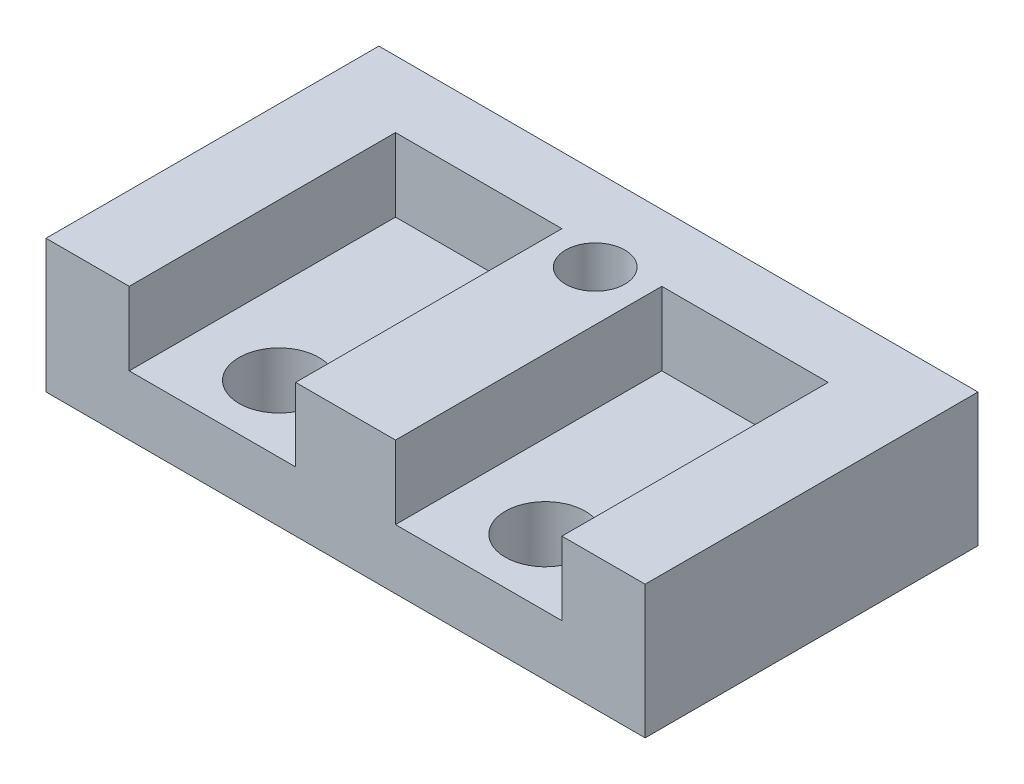
ISO-10303-21;
HEADER;
FILE_DESCRIPTION(('STEP AP214'),'2;1');
FILE_NAME('part.step','',(''),(''),'','','');
FILE_SCHEMA(('AUTOMOTIVE_DESIGN { 1 0 10303 214 1 1 1 1 }'));
ENDSEC;
DATA;
#1=APPLICATION_CONTEXT('core data for automotive mechanical design processes');
#2=APPLICATION_PROTOCOL_DEFINITION('international standard','automotive_design',2000,#1);
#3=PRODUCT_CONTEXT('',#1,'mechanical');
#4=PRODUCT('Part','Part','',(#3));
#5=PRODUCT_RELATED_PRODUCT_CATEGORY('part','',(#4));
#6=PRODUCT_DEFINITION_FORMATION('','',#4);
#7=PRODUCT_DEFINITION_CONTEXT('part definition',#1,'design');
#8=PRODUCT_DEFINITION('design','',#6,#7);
#9=PRODUCT_DEFINITION_SHAPE('','',#8);
#10=(LENGTH_UNIT() NAMED_UNIT(*) SI_UNIT(.MILLI.,.METRE.));
#11=(NAMED_UNIT(*) PLANE_ANGLE_UNIT() SI_UNIT($,.RADIAN.));
#12=(NAMED_UNIT(*) SI_UNIT($,.STERADIAN.) SOLID_ANGLE_UNIT());
#13=UNCERTAINTY_MEASURE_WITH_UNIT(LENGTH_MEASURE(1.E-05),#10,'distance_accuracy_value','');
#14=(GEOMETRIC_REPRESENTATION_CONTEXT(3) GLOBAL_UNCERTAINTY_ASSIGNED_CONTEXT((#13)) GLOBAL_UNIT_ASSIGNED_CONTEXT((#10,
#11,#12)) REPRESENTATION_CONTEXT('',''));
#15=CARTESIAN_POINT('',(0.,0.,0.));
#16=DIRECTION('',(0.,0.,1.));
#17=DIRECTION('',(1.,0.,0.));
#18=AXIS2_PLACEMENT_3D('',#15,#16,#17);
#19=CARTESIAN_POINT('',(11.43,5.08,6.35));
#20=DIRECTION('',(-1.,0.,0.));
#21=DIRECTION('',(0.,0.,1.));
#22=AXIS2_PLACEMENT_3D('',#19,#20,#21);
#23=PLANE('',#22);
#24=DIRECTION('',(0.,0.,-1.));
#25=VECTOR('',#24,1.);
#26=CARTESIAN_POINT('',(11.43,0.,6.35));
#27=LINE('',#26,#25);
#28=CARTESIAN_POINT('',(11.43,0.,6.35));
#29=VERTEX_POINT('',#28);
#30=CARTESIAN_POINT('',(11.43,0.,-6.35));
#31=VERTEX_POINT('',#30);
#32=EDGE_CURVE('E203',#29,#31,#27,.T.);
#33=ORIENTED_EDGE('',*,*,#32,.T.);
#34=DIRECTION('',(0.,-1.,0.));
#35=VECTOR('',#34,1.);
#36=CARTESIAN_POINT('',(11.43,5.08,-6.35));
#37=LINE('',#36,#35);
#38=CARTESIAN_POINT('',(11.43,5.08,-6.35));
#39=VERTEX_POINT('',#38);
#40=EDGE_CURVE('E11',#39,#31,#37,.T.);
#41=ORIENTED_EDGE('',*,*,#40,.F.);
#42=DIRECTION('',(0.,0.,-1.));
#43=VECTOR('',#42,1.);
#44=CARTESIAN_POINT('',(11.43,5.08,6.35));
#45=LINE('',#44,#43);
#46=CARTESIAN_POINT('',(11.43,5.08,6.35));
#47=VERTEX_POINT('',#46);
#48=EDGE_CURVE('E204',#47,#39,#45,.T.);
#49=ORIENTED_EDGE('',*,*,#48,.F.);
#50=DIRECTION('',(0.,-1.,0.));
#51=VECTOR('',#50,1.);
#52=CARTESIAN_POINT('',(11.43,5.08,6.35));
#53=LINE('',#52,#51);
#54=EDGE_CURVE('E216',#47,#29,#53,.T.);
#55=ORIENTED_EDGE('',*,*,#54,.T.);
#56=EDGE_LOOP('',(#33,#41,#49,#55));
#57=FACE_BOUND('',#56,.T.);
#58=ADVANCED_FACE('F45',(#57),#23,.F.);
#59=CARTESIAN_POINT('',(-11.43,5.08,-6.35));
#60=DIRECTION('',(0.,0.,1.));
#61=DIRECTION('',(1.,0.,0.));
#62=AXIS2_PLACEMENT_3D('',#59,#60,#61);
#63=PLANE('',#62);
#64=DIRECTION('',(-1.,0.,0.));
#65=VECTOR('',#64,1.);
#66=CARTESIAN_POINT('',(-11.43,0.,-6.35));
#67=LINE('',#66,#65);
#68=CARTESIAN_POINT('',(-11.43,0.,-6.35));
#69=VERTEX_POINT('',#68);
#70=EDGE_CURVE('E220',#31,#69,#67,.T.);
#71=ORIENTED_EDGE('',*,*,#70,.T.);
#72=DIRECTION('',(0.,-1.,0.));
#73=VECTOR('',#72,1.);
#74=CARTESIAN_POINT('',(-11.43,5.08,-6.35));
#75=LINE('',#74,#73);
#76=CARTESIAN_POINT('',(-11.43,5.08,-6.35));
#77=VERTEX_POINT('',#76);
#78=EDGE_CURVE('E52',#77,#69,#75,.T.);
#79=ORIENTED_EDGE('',*,*,#78,.F.);
#80=DIRECTION('',(-1.,0.,0.));
#81=VECTOR('',#80,1.);
#82=CARTESIAN_POINT('',(-11.43,5.08,-6.35));
#83=LINE('',#82,#81);
#84=EDGE_CURVE('E207',#39,#77,#83,.T.);
#85=ORIENTED_EDGE('',*,*,#84,.F.);
#86=ORIENTED_EDGE('',*,*,#40,.T.);
#87=EDGE_LOOP('',(#71,#79,#85,#86));
#88=FACE_BOUND('',#87,.T.);
#89=ADVANCED_FACE('F278',(#88),#63,.F.);
#90=CARTESIAN_POINT('',(-11.43,5.08,6.35));
#91=DIRECTION('',(1.,0.,0.));
#92=DIRECTION('',(0.,0.,-1.));
#93=AXIS2_PLACEMENT_3D('',#90,#91,#92);
#94=PLANE('',#93);
#95=DIRECTION('',(0.,0.,1.));
#96=VECTOR('',#95,1.);
#97=CARTESIAN_POINT('',(-11.43,0.,6.35));
#98=LINE('',#97,#96);
#99=CARTESIAN_POINT('',(-11.43,0.,6.35));
#100=VERTEX_POINT('',#99);
#101=EDGE_CURVE('E222',#69,#100,#98,.T.);
#102=ORIENTED_EDGE('',*,*,#101,.T.);
#103=DIRECTION('',(0.,-1.,0.));
#104=VECTOR('',#103,1.);
#105=CARTESIAN_POINT('',(-11.43,5.08,6.35));
#106=LINE('',#105,#104);
#107=CARTESIAN_POINT('',(-11.43,5.08,6.35));
#108=VERTEX_POINT('',#107);
#109=EDGE_CURVE('E227',#108,#100,#106,.T.);
#110=ORIENTED_EDGE('',*,*,#109,.F.);
#111=DIRECTION('',(0.,0.,1.));
#112=VECTOR('',#111,1.);
#113=CARTESIAN_POINT('',(-11.43,5.08,6.35));
#114=LINE('',#113,#112);
#115=EDGE_CURVE('E210',#77,#108,#114,.T.);
#116=ORIENTED_EDGE('',*,*,#115,.F.);
#117=ORIENTED_EDGE('',*,*,#78,.T.);
#118=EDGE_LOOP('',(#102,#110,#116,#117));
#119=FACE_BOUND('',#118,.T.);
#120=ADVANCED_FACE('F234',(#119),#94,.F.);
#121=CARTESIAN_POINT('',(-11.43,5.08,6.35));
#122=DIRECTION('',(0.,0.,-1.));
#123=DIRECTION('',(-1.,0.,0.));
#124=AXIS2_PLACEMENT_3D('',#121,#122,#123);
#125=PLANE('',#124);
#126=DIRECTION('',(1.,0.,0.));
#127=VECTOR('',#126,1.);
#128=CARTESIAN_POINT('',(-11.43,5.08,6.35));
#129=LINE('',#128,#127);
#130=CARTESIAN_POINT('',(-1.905,5.08,6.35));
#131=VERTEX_POINT('',#130);
#132=CARTESIAN_POINT('',(1.905,5.08,6.35));
#133=VERTEX_POINT('',#132);
#134=EDGE_CURVE('E217',#131,#133,#129,.T.);
#135=ORIENTED_EDGE('',*,*,#134,.F.);
#136=DIRECTION('',(0.,1.,0.));
#137=VECTOR('',#136,1.);
#138=CARTESIAN_POINT('',(-1.905,2.286,6.35));
#139=LINE('',#138,#137);
#140=CARTESIAN_POINT('',(-1.905,2.286,6.35));
#141=VERTEX_POINT('',#140);
#142=EDGE_CURVE('E165',#141,#131,#139,.T.);
#143=ORIENTED_EDGE('',*,*,#142,.F.);
#144=DIRECTION('',(1.,0.,0.));
#145=VECTOR('',#144,1.);
#146=CARTESIAN_POINT('',(-1.905,2.286,6.35));
#147=LINE('',#146,#145);
#148=CARTESIAN_POINT('',(-8.255,2.286,6.35));
#149=VERTEX_POINT('',#148);
#150=EDGE_CURVE('E140',#149,#141,#147,.T.);
#151=ORIENTED_EDGE('',*,*,#150,.F.);
#152=DIRECTION('',(0.,1.,0.));
#153=VECTOR('',#152,1.);
#154=CARTESIAN_POINT('',(-8.255,2.286,6.35));
#155=LINE('',#154,#153);
#156=CARTESIAN_POINT('',(-8.255,5.08,6.35));
#157=VERTEX_POINT('',#156);
#158=EDGE_CURVE('E168',#149,#157,#155,.T.);
#159=ORIENTED_EDGE('',*,*,#158,.T.);
#160=EDGE_CURVE('E213',#108,#157,#129,.T.);
#161=ORIENTED_EDGE('',*,*,#160,.F.);
#162=ORIENTED_EDGE('',*,*,#109,.T.);
#163=DIRECTION('',(1.,0.,0.));
#164=VECTOR('',#163,1.);
#165=CARTESIAN_POINT('',(-11.43,0.,6.35));
#166=LINE('',#165,#164);
#167=EDGE_CURVE('E208',#100,#29,#166,.T.);
#168=ORIENTED_EDGE('',*,*,#167,.T.);
#169=ORIENTED_EDGE('',*,*,#54,.F.);
#170=CARTESIAN_POINT('',(8.255,5.08,6.35));
#171=VERTEX_POINT('',#170);
#172=EDGE_CURVE('E212',#171,#47,#129,.T.);
#173=ORIENTED_EDGE('',*,*,#172,.F.);
#174=DIRECTION('',(0.,1.,0.));
#175=VECTOR('',#174,1.);
#176=CARTESIAN_POINT('',(8.255,2.286,6.35));
#177=LINE('',#176,#175);
#178=CARTESIAN_POINT('',(8.255,2.286,6.35));
#179=VERTEX_POINT('',#178);
#180=EDGE_CURVE('E178',#179,#171,#177,.T.);
#181=ORIENTED_EDGE('',*,*,#180,.F.);
#182=DIRECTION('',(1.,0.,0.));
#183=VECTOR('',#182,1.);
#184=CARTESIAN_POINT('',(1.905,2.286,6.35));
#185=LINE('',#184,#183);
#186=CARTESIAN_POINT('',(1.905,2.286,6.35));
#187=VERTEX_POINT('',#186);
#188=EDGE_CURVE('E191',#187,#179,#185,.T.);
#189=ORIENTED_EDGE('',*,*,#188,.F.);
#190=DIRECTION('',(0.,1.,0.));
#191=VECTOR('',#190,1.);
#192=CARTESIAN_POINT('',(1.905,2.286,6.35));
#193=LINE('',#192,#191);
#194=EDGE_CURVE('E175',#187,#133,#193,.T.);
#195=ORIENTED_EDGE('',*,*,#194,.T.);
#196=EDGE_LOOP('',(#135,#143,#151,#159,#161,#162,#168,#169,#173,#181,#189,#195));
#197=FACE_BOUND('',#196,.T.);
#198=ADVANCED_FACE('F244',(#197),#125,.F.);
#199=CARTESIAN_POINT('',(0.,5.08,0.));
#200=DIRECTION('',(0.,-1.,0.));
#201=DIRECTION('',(0.,0.,-1.));
#202=AXIS2_PLACEMENT_3D('',#199,#200,#201);
#203=PLANE('',#202);
#204=CARTESIAN_POINT('',(0.,5.08,-3.175));
#205=DIRECTION('',(0.,1.,0.));
#206=DIRECTION('',(0.,0.,1.));
#207=AXIS2_PLACEMENT_3D('',#204,#205,#206);
#208=CIRCLE('',#207,1.13029999999999);
#209=CARTESIAN_POINT('',(0.,5.08,-2.04470000000001));
#210=VERTEX_POINT('',#209);
#211=EDGE_CURVE('E167',#210,#210,#208,.T.);
#212=ORIENTED_EDGE('',*,*,#211,.F.);
#213=EDGE_LOOP('',(#212));
#214=FACE_BOUND('',#213,.T.);
#215=DIRECTION('',(-1.,0.,0.));
#216=VECTOR('',#215,1.);
#217=CARTESIAN_POINT('',(-1.905,5.08,-3.81));
#218=LINE('',#217,#216);
#219=CARTESIAN_POINT('',(-1.905,5.08,-3.81));
#220=VERTEX_POINT('',#219);
#221=CARTESIAN_POINT('',(-8.255,5.08,-3.81));
#222=VERTEX_POINT('',#221);
#223=EDGE_CURVE('E155',#220,#222,#218,.T.);
#224=ORIENTED_EDGE('',*,*,#223,.F.);
#225=DIRECTION('',(0.,0.,-1.));
#226=VECTOR('',#225,1.);
#227=CARTESIAN_POINT('',(-1.905,5.08,-3.81));
#228=LINE('',#227,#226);
#229=EDGE_CURVE('E59',#131,#220,#228,.T.);
#230=ORIENTED_EDGE('',*,*,#229,.F.);
#231=ORIENTED_EDGE('',*,*,#134,.T.);
#232=DIRECTION('',(0.,0.,1.));
#233=VECTOR('',#232,1.);
#234=CARTESIAN_POINT('',(1.905,5.08,-3.81));
#235=LINE('',#234,#233);
#236=CARTESIAN_POINT('',(1.905,5.08,-3.81));
#237=VERTEX_POINT('',#236);
#238=EDGE_CURVE('E185',#237,#133,#235,.T.);
#239=ORIENTED_EDGE('',*,*,#238,.F.);
#240=DIRECTION('',(-1.,0.,0.));
#241=VECTOR('',#240,1.);
#242=CARTESIAN_POINT('',(1.905,5.08,-3.81));
#243=LINE('',#242,#241);
#244=CARTESIAN_POINT('',(8.255,5.08,-3.81));
#245=VERTEX_POINT('',#244);
#246=EDGE_CURVE('E67',#245,#237,#243,.T.);
#247=ORIENTED_EDGE('',*,*,#246,.F.);
#248=DIRECTION('',(0.,0.,-1.));
#249=VECTOR('',#248,1.);
#250=CARTESIAN_POINT('',(8.255,5.08,-3.81));
#251=LINE('',#250,#249);
#252=EDGE_CURVE('E182',#171,#245,#251,.T.);
#253=ORIENTED_EDGE('',*,*,#252,.F.);
#254=ORIENTED_EDGE('',*,*,#172,.T.);
#255=ORIENTED_EDGE('',*,*,#48,.T.);
#256=ORIENTED_EDGE('',*,*,#84,.T.);
#257=ORIENTED_EDGE('',*,*,#115,.T.);
#258=ORIENTED_EDGE('',*,*,#160,.T.);
#259=DIRECTION('',(0.,0.,1.));
#260=VECTOR('',#259,1.);
#261=CARTESIAN_POINT('',(-8.255,5.08,-3.81));
#262=LINE('',#261,#260);
#263=EDGE_CURVE('E153',#222,#157,#262,.T.);
#264=ORIENTED_EDGE('',*,*,#263,.F.);
#265=EDGE_LOOP('',(#224,#230,#231,#239,#247,#253,#254,#255,#256,#257,#258,#264));
#266=FACE_BOUND('',#265,.T.);
#267=ADVANCED_FACE('F251',(#214,#266),#203,.F.);
#268=CARTESIAN_POINT('',(0.,0.,0.));
#269=DIRECTION('',(0.,-1.,0.));
#270=DIRECTION('',(0.,0.,-1.));
#271=AXIS2_PLACEMENT_3D('',#268,#269,#270);
#272=PLANE('',#271);
#273=CARTESIAN_POINT('',(-5.08,0.,3.81));
#274=DIRECTION('',(0.,-1.,0.));
#275=DIRECTION('',(0.,0.,-1.));
#276=AXIS2_PLACEMENT_3D('',#273,#274,#275);
#277=CIRCLE('',#276,1.524);
#278=CARTESIAN_POINT('',(-5.08,0.,2.286));
#279=VERTEX_POINT('',#278);
#280=EDGE_CURVE('E308',#279,#279,#277,.T.);
#281=ORIENTED_EDGE('',*,*,#280,.F.);
#282=EDGE_LOOP('',(#281));
#283=FACE_BOUND('',#282,.T.);
#284=CARTESIAN_POINT('',(5.08,0.,3.81));
#285=DIRECTION('',(0.,-1.,0.));
#286=DIRECTION('',(0.,0.,-1.));
#287=AXIS2_PLACEMENT_3D('',#284,#285,#286);
#288=CIRCLE('',#287,1.524);
#289=CARTESIAN_POINT('',(5.08,0.,2.286));
#290=VERTEX_POINT('',#289);
#291=EDGE_CURVE('E158',#290,#290,#288,.T.);
#292=ORIENTED_EDGE('',*,*,#291,.F.);
#293=EDGE_LOOP('',(#292));
#294=FACE_BOUND('',#293,.T.);
#295=CARTESIAN_POINT('',(0.,0.,-3.175));
#296=DIRECTION('',(0.,-1.,0.));
#297=DIRECTION('',(0.,0.,-1.));
#298=AXIS2_PLACEMENT_3D('',#295,#296,#297);
#299=CIRCLE('',#298,1.13029999999999);
#300=CARTESIAN_POINT('',(0.,0.,-4.30529999999999));
#301=VERTEX_POINT('',#300);
#302=EDGE_CURVE('E200',#301,#301,#299,.T.);
#303=ORIENTED_EDGE('',*,*,#302,.F.);
#304=EDGE_LOOP('',(#303));
#305=FACE_BOUND('',#304,.T.);
#306=ORIENTED_EDGE('',*,*,#32,.F.);
#307=ORIENTED_EDGE('',*,*,#167,.F.);
#308=ORIENTED_EDGE('',*,*,#101,.F.);
#309=ORIENTED_EDGE('',*,*,#70,.F.);
#310=EDGE_LOOP('',(#306,#307,#308,#309));
#311=FACE_BOUND('',#310,.T.);
#312=ADVANCED_FACE('F240',(#283,#294,#305,#311),#272,.T.);
#313=CARTESIAN_POINT('',(0.,5.08,-3.175));
#314=DIRECTION('',(0.,1.,0.));
#315=DIRECTION('',(0.,0.,1.));
#316=AXIS2_PLACEMENT_3D('',#313,#314,#315);
#317=CYLINDRICAL_SURFACE('',#316,1.13029999999999);
#318=ORIENTED_EDGE('',*,*,#302,.T.);
#319=EDGE_LOOP('',(#318));
#320=FACE_BOUND('',#319,.T.);
#321=ORIENTED_EDGE('',*,*,#211,.T.);
#322=EDGE_LOOP('',(#321));
#323=FACE_BOUND('',#322,.T.);
#324=ADVANCED_FACE('F274',(#320,#323),#317,.F.);
#325=CARTESIAN_POINT('',(1.905,2.286,-3.81));
#326=DIRECTION('',(0.,0.,-1.));
#327=DIRECTION('',(-1.,0.,0.));
#328=AXIS2_PLACEMENT_3D('',#325,#326,#327);
#329=PLANE('',#328);
#330=ORIENTED_EDGE('',*,*,#246,.T.);
#331=DIRECTION('',(0.,1.,0.));
#332=VECTOR('',#331,1.);
#333=CARTESIAN_POINT('',(1.905,2.286,-3.81));
#334=LINE('',#333,#332);
#335=CARTESIAN_POINT('',(1.905,2.286,-3.81));
#336=VERTEX_POINT('',#335);
#337=EDGE_CURVE('E172',#336,#237,#334,.T.);
#338=ORIENTED_EDGE('',*,*,#337,.F.);
#339=DIRECTION('',(-1.,0.,0.));
#340=VECTOR('',#339,1.);
#341=CARTESIAN_POINT('',(1.905,2.286,-3.81));
#342=LINE('',#341,#340);
#343=CARTESIAN_POINT('',(8.255,2.286,-3.81));
#344=VERTEX_POINT('',#343);
#345=EDGE_CURVE('E186',#344,#336,#342,.T.);
#346=ORIENTED_EDGE('',*,*,#345,.F.);
#347=DIRECTION('',(0.,1.,0.));
#348=VECTOR('',#347,1.);
#349=CARTESIAN_POINT('',(8.255,2.286,-3.81));
#350=LINE('',#349,#348);
#351=EDGE_CURVE('E180',#344,#245,#350,.T.);
#352=ORIENTED_EDGE('',*,*,#351,.T.);
#353=EDGE_LOOP('',(#330,#338,#346,#352));
#354=FACE_BOUND('',#353,.T.);
#355=ADVANCED_FACE('F264',(#354),#329,.F.);
#356=CARTESIAN_POINT('',(8.255,2.286,-3.81));
#357=DIRECTION('',(1.,0.,0.));
#358=DIRECTION('',(0.,0.,-1.));
#359=AXIS2_PLACEMENT_3D('',#356,#357,#358);
#360=PLANE('',#359);
#361=ORIENTED_EDGE('',*,*,#252,.T.);
#362=ORIENTED_EDGE('',*,*,#351,.F.);
#363=DIRECTION('',(0.,0.,-1.));
#364=VECTOR('',#363,1.);
#365=CARTESIAN_POINT('',(8.255,2.286,-3.81));
#366=LINE('',#365,#364);
#367=EDGE_CURVE('E174',#179,#344,#366,.T.);
#368=ORIENTED_EDGE('',*,*,#367,.F.);
#369=ORIENTED_EDGE('',*,*,#180,.T.);
#370=EDGE_LOOP('',(#361,#362,#368,#369));
#371=FACE_BOUND('',#370,.T.);
#372=ADVANCED_FACE('F266',(#371),#360,.F.);
#373=CARTESIAN_POINT('',(1.905,2.286,-3.81));
#374=DIRECTION('',(-1.,0.,0.));
#375=DIRECTION('',(0.,0.,1.));
#376=AXIS2_PLACEMENT_3D('',#373,#374,#375);
#377=PLANE('',#376);
#378=ORIENTED_EDGE('',*,*,#238,.T.);
#379=ORIENTED_EDGE('',*,*,#194,.F.);
#380=DIRECTION('',(0.,0.,1.));
#381=VECTOR('',#380,1.);
#382=CARTESIAN_POINT('',(1.905,2.286,-3.81));
#383=LINE('',#382,#381);
#384=EDGE_CURVE('E193',#336,#187,#383,.T.);
#385=ORIENTED_EDGE('',*,*,#384,.F.);
#386=ORIENTED_EDGE('',*,*,#337,.T.);
#387=EDGE_LOOP('',(#378,#379,#385,#386));
#388=FACE_BOUND('',#387,.T.);
#389=ADVANCED_FACE('F259',(#388),#377,.F.);
#390=CARTESIAN_POINT('',(0.,2.286,0.));
#391=DIRECTION('',(0.,-1.,0.));
#392=DIRECTION('',(0.,0.,-1.));
#393=AXIS2_PLACEMENT_3D('',#390,#391,#392);
#394=PLANE('',#393);
#395=CARTESIAN_POINT('',(5.08,2.286,3.81));
#396=DIRECTION('',(0.,1.,0.));
#397=DIRECTION('',(0.,0.,1.));
#398=AXIS2_PLACEMENT_3D('',#395,#396,#397);
#399=CIRCLE('',#398,1.524);
#400=CARTESIAN_POINT('',(5.08,2.286,5.334));
#401=VERTEX_POINT('',#400);
#402=EDGE_CURVE('E306',#401,#401,#399,.T.);
#403=ORIENTED_EDGE('',*,*,#402,.F.);
#404=EDGE_LOOP('',(#403));
#405=FACE_BOUND('',#404,.T.);
#406=ORIENTED_EDGE('',*,*,#345,.T.);
#407=ORIENTED_EDGE('',*,*,#384,.T.);
#408=ORIENTED_EDGE('',*,*,#188,.T.);
#409=ORIENTED_EDGE('',*,*,#367,.T.);
#410=EDGE_LOOP('',(#406,#407,#408,#409));
#411=FACE_BOUND('',#410,.T.);
#412=ADVANCED_FACE('F261',(#405,#411),#394,.F.);
#413=CARTESIAN_POINT('',(-1.905,2.286,-3.81));
#414=DIRECTION('',(1.,0.,0.));
#415=DIRECTION('',(0.,0.,-1.));
#416=AXIS2_PLACEMENT_3D('',#413,#414,#415);
#417=PLANE('',#416);
#418=ORIENTED_EDGE('',*,*,#229,.T.);
#419=DIRECTION('',(0.,1.,0.));
#420=VECTOR('',#419,1.);
#421=CARTESIAN_POINT('',(-1.905,2.286,-3.81));
#422=LINE('',#421,#420);
#423=CARTESIAN_POINT('',(-1.905,2.286,-3.81));
#424=VERTEX_POINT('',#423);
#425=EDGE_CURVE('E130',#424,#220,#422,.T.);
#426=ORIENTED_EDGE('',*,*,#425,.F.);
#427=DIRECTION('',(0.,0.,-1.));
#428=VECTOR('',#427,1.);
#429=CARTESIAN_POINT('',(-1.905,2.286,-3.81));
#430=LINE('',#429,#428);
#431=EDGE_CURVE('E134',#141,#424,#430,.T.);
#432=ORIENTED_EDGE('',*,*,#431,.F.);
#433=ORIENTED_EDGE('',*,*,#142,.T.);
#434=EDGE_LOOP('',(#418,#426,#432,#433));
#435=FACE_BOUND('',#434,.T.);
#436=ADVANCED_FACE('F132',(#435),#417,.F.);
#437=CARTESIAN_POINT('',(-8.255,2.286,-3.81));
#438=DIRECTION('',(-1.,0.,0.));
#439=DIRECTION('',(0.,0.,1.));
#440=AXIS2_PLACEMENT_3D('',#437,#438,#439);
#441=PLANE('',#440);
#442=ORIENTED_EDGE('',*,*,#263,.T.);
#443=ORIENTED_EDGE('',*,*,#158,.F.);
#444=DIRECTION('',(0.,0.,1.));
#445=VECTOR('',#444,1.);
#446=CARTESIAN_POINT('',(-8.255,2.286,-3.81));
#447=LINE('',#446,#445);
#448=CARTESIAN_POINT('',(-8.255,2.286,-3.81));
#449=VERTEX_POINT('',#448);
#450=EDGE_CURVE('E148',#449,#149,#447,.T.);
#451=ORIENTED_EDGE('',*,*,#450,.F.);
#452=DIRECTION('',(0.,1.,0.));
#453=VECTOR('',#452,1.);
#454=CARTESIAN_POINT('',(-8.255,2.286,-3.81));
#455=LINE('',#454,#453);
#456=EDGE_CURVE('E139',#449,#222,#455,.T.);
#457=ORIENTED_EDGE('',*,*,#456,.T.);
#458=EDGE_LOOP('',(#442,#443,#451,#457));
#459=FACE_BOUND('',#458,.T.);
#460=ADVANCED_FACE('F302',(#459),#441,.F.);
#461=CARTESIAN_POINT('',(-1.905,2.286,-3.81));
#462=DIRECTION('',(0.,0.,-1.));
#463=DIRECTION('',(-1.,0.,0.));
#464=AXIS2_PLACEMENT_3D('',#461,#462,#463);
#465=PLANE('',#464);
#466=ORIENTED_EDGE('',*,*,#223,.T.);
#467=ORIENTED_EDGE('',*,*,#456,.F.);
#468=DIRECTION('',(-1.,0.,0.));
#469=VECTOR('',#468,1.);
#470=CARTESIAN_POINT('',(-1.905,2.286,-3.81));
#471=LINE('',#470,#469);
#472=EDGE_CURVE('E143',#424,#449,#471,.T.);
#473=ORIENTED_EDGE('',*,*,#472,.F.);
#474=ORIENTED_EDGE('',*,*,#425,.T.);
#475=EDGE_LOOP('',(#466,#467,#473,#474));
#476=FACE_BOUND('',#475,.T.);
#477=ADVANCED_FACE('F144',(#476),#465,.F.);
#478=CARTESIAN_POINT('',(0.,2.286,0.));
#479=DIRECTION('',(0.,-1.,0.));
#480=DIRECTION('',(0.,0.,-1.));
#481=AXIS2_PLACEMENT_3D('',#478,#479,#480);
#482=PLANE('',#481);
#483=CARTESIAN_POINT('',(-5.08,2.286,3.81));
#484=DIRECTION('',(0.,1.,0.));
#485=DIRECTION('',(0.,0.,1.));
#486=AXIS2_PLACEMENT_3D('',#483,#484,#485);
#487=CIRCLE('',#486,1.524);
#488=CARTESIAN_POINT('',(-5.08,2.286,5.334));
#489=VERTEX_POINT('',#488);
#490=EDGE_CURVE('E311',#489,#489,#487,.T.);
#491=ORIENTED_EDGE('',*,*,#490,.F.);
#492=EDGE_LOOP('',(#491));
#493=FACE_BOUND('',#492,.T.);
#494=ORIENTED_EDGE('',*,*,#431,.T.);
#495=ORIENTED_EDGE('',*,*,#472,.T.);
#496=ORIENTED_EDGE('',*,*,#450,.T.);
#497=ORIENTED_EDGE('',*,*,#150,.T.);
#498=EDGE_LOOP('',(#494,#495,#496,#497));
#499=FACE_BOUND('',#498,.T.);
#500=ADVANCED_FACE('F150',(#493,#499),#482,.F.);
#501=CARTESIAN_POINT('',(5.08,2.286,3.81));
#502=DIRECTION('',(0.,1.,0.));
#503=DIRECTION('',(0.,0.,1.));
#504=AXIS2_PLACEMENT_3D('',#501,#502,#503);
#505=CYLINDRICAL_SURFACE('',#504,1.524);
#506=ORIENTED_EDGE('',*,*,#291,.T.);
#507=EDGE_LOOP('',(#506));
#508=FACE_BOUND('',#507,.T.);
#509=ORIENTED_EDGE('',*,*,#402,.T.);
#510=EDGE_LOOP('',(#509));
#511=FACE_BOUND('',#510,.T.);
#512=ADVANCED_FACE('F320',(#508,#511),#505,.F.);
#513=CARTESIAN_POINT('',(-5.08,2.286,3.81));
#514=DIRECTION('',(0.,1.,0.));
#515=DIRECTION('',(0.,0.,1.));
#516=AXIS2_PLACEMENT_3D('',#513,#514,#515);
#517=CYLINDRICAL_SURFACE('',#516,1.524);
#518=ORIENTED_EDGE('',*,*,#280,.T.);
#519=EDGE_LOOP('',(#518));
#520=FACE_BOUND('',#519,.T.);
#521=ORIENTED_EDGE('',*,*,#490,.T.);
#522=EDGE_LOOP('',(#521));
#523=FACE_BOUND('',#522,.T.);
#524=ADVANCED_FACE('F317',(#520,#523),#517,.F.);
#525=CLOSED_SHELL('',(#58,#89,#120,#198,#267,#312,#324,#355,#372,#389,#412,#436,#460,#477,#500,
#512,#524));
#526=MANIFOLD_SOLID_BREP('B2',#525);
#527=ADVANCED_BREP_SHAPE_REPRESENTATION('',(#18,#526),#14);
#528=SHAPE_DEFINITION_REPRESENTATION(#9,#527);
ENDSEC;
END-ISO-10303-21;
